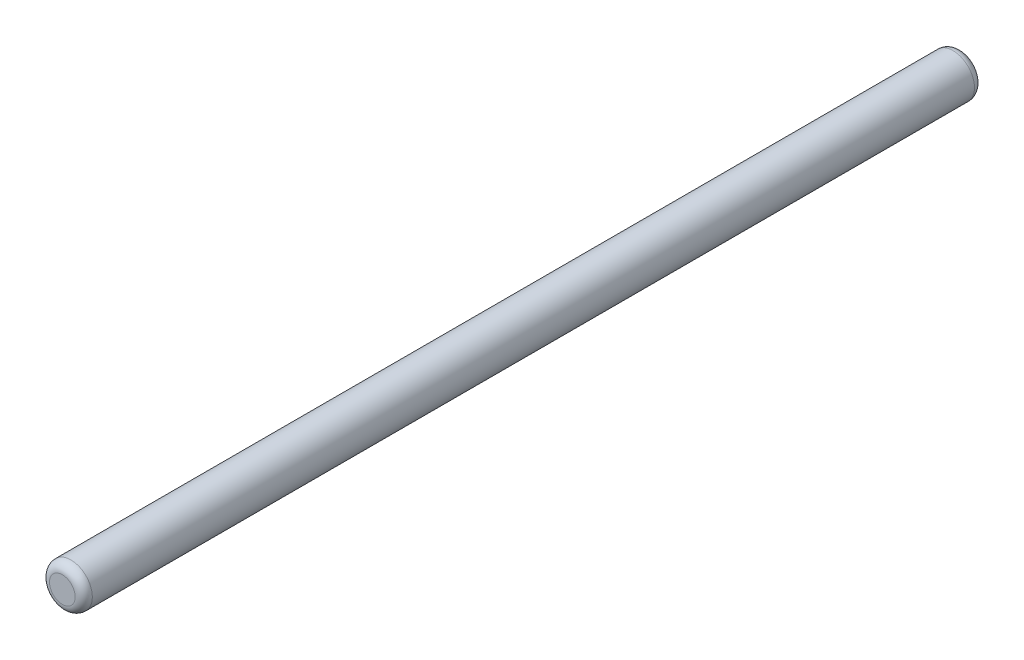
ISO-10303-21;
HEADER;
FILE_DESCRIPTION(('STEP AP214'),'2;1');
FILE_NAME('part.step','',(''),(''),'','','');
FILE_SCHEMA(('AUTOMOTIVE_DESIGN { 1 0 10303 214 1 1 1 1 }'));
ENDSEC;
DATA;
#1=APPLICATION_CONTEXT('core data for automotive mechanical design processes');
#2=APPLICATION_PROTOCOL_DEFINITION('international standard','automotive_design',2000,#1);
#3=PRODUCT_CONTEXT('',#1,'mechanical');
#4=PRODUCT('Part','Part','',(#3));
#5=PRODUCT_RELATED_PRODUCT_CATEGORY('part','',(#4));
#6=PRODUCT_DEFINITION_FORMATION('','',#4);
#7=PRODUCT_DEFINITION_CONTEXT('part definition',#1,'design');
#8=PRODUCT_DEFINITION('design','',#6,#7);
#9=PRODUCT_DEFINITION_SHAPE('','',#8);
#10=(LENGTH_UNIT() NAMED_UNIT(*) SI_UNIT(.MILLI.,.METRE.));
#11=(NAMED_UNIT(*) PLANE_ANGLE_UNIT() SI_UNIT($,.RADIAN.));
#12=(NAMED_UNIT(*) SI_UNIT($,.STERADIAN.) SOLID_ANGLE_UNIT());
#13=UNCERTAINTY_MEASURE_WITH_UNIT(LENGTH_MEASURE(1.E-05),#10,'distance_accuracy_value','');
#14=(GEOMETRIC_REPRESENTATION_CONTEXT(3) GLOBAL_UNCERTAINTY_ASSIGNED_CONTEXT((#13)) GLOBAL_UNIT_ASSIGNED_CONTEXT((#10,
#11,#12)) REPRESENTATION_CONTEXT('',''));
#15=CARTESIAN_POINT('',(0.,0.,0.));
#16=DIRECTION('',(0.,0.,1.));
#17=DIRECTION('',(1.,0.,0.));
#18=AXIS2_PLACEMENT_3D('',#15,#16,#17);
#19=CARTESIAN_POINT('',(0.,0.,105.));
#20=DIRECTION('',(0.,0.,-1.));
#21=DIRECTION('',(-1.,0.,0.));
#22=AXIS2_PLACEMENT_3D('',#19,#20,#21);
#23=CYLINDRICAL_SURFACE('',#22,2.5);
#24=CARTESIAN_POINT('',(0.,0.,1.));
#25=DIRECTION('',(0.,0.,1.));
#26=DIRECTION('',(1.,0.,0.));
#27=AXIS2_PLACEMENT_3D('',#24,#25,#26);
#28=CIRCLE('',#27,2.5);
#29=CARTESIAN_POINT('',(2.5,0.,1.));
#30=VERTEX_POINT('',#29);
#31=EDGE_CURVE('E44',#30,#30,#28,.T.);
#32=ORIENTED_EDGE('',*,*,#31,.T.);
#33=EDGE_LOOP('',(#32));
#34=FACE_BOUND('',#33,.T.);
#35=CARTESIAN_POINT('',(0.,0.,104.));
#36=DIRECTION('',(0.,0.,1.));
#37=DIRECTION('',(1.,0.,0.));
#38=AXIS2_PLACEMENT_3D('',#35,#36,#37);
#39=CIRCLE('',#38,2.5);
#40=CARTESIAN_POINT('',(2.5,0.,104.));
#41=VERTEX_POINT('',#40);
#42=EDGE_CURVE('E48',#41,#41,#39,.F.);
#43=ORIENTED_EDGE('',*,*,#42,.T.);
#44=EDGE_LOOP('',(#43));
#45=FACE_BOUND('',#44,.T.);
#46=ADVANCED_FACE('F33',(#34,#45),#23,.T.);
#47=CARTESIAN_POINT('',(0.,0.,105.));
#48=DIRECTION('',(0.,0.,1.));
#49=DIRECTION('',(1.,0.,0.));
#50=AXIS2_PLACEMENT_3D('',#47,#48,#49);
#51=PLANE('',#50);
#52=CARTESIAN_POINT('',(0.,0.,105.));
#53=DIRECTION('',(0.,0.,1.));
#54=DIRECTION('',(1.,0.,0.));
#55=AXIS2_PLACEMENT_3D('',#52,#53,#54);
#56=CIRCLE('',#55,1.5);
#57=CARTESIAN_POINT('',(1.5,0.,105.));
#58=VERTEX_POINT('',#57);
#59=EDGE_CURVE('E10',#58,#58,#56,.T.);
#60=ORIENTED_EDGE('',*,*,#59,.T.);
#61=EDGE_LOOP('',(#60));
#62=FACE_BOUND('',#61,.T.);
#63=ADVANCED_FACE('F64',(#62),#51,.T.);
#64=CARTESIAN_POINT('',(0.,0.,0.));
#65=DIRECTION('',(0.,0.,1.));
#66=DIRECTION('',(1.,0.,0.));
#67=AXIS2_PLACEMENT_3D('',#64,#65,#66);
#68=PLANE('',#67);
#69=CARTESIAN_POINT('',(0.,0.,0.));
#70=DIRECTION('',(0.,0.,1.));
#71=DIRECTION('',(1.,0.,0.));
#72=AXIS2_PLACEMENT_3D('',#69,#70,#71);
#73=CIRCLE('',#72,1.5);
#74=CARTESIAN_POINT('',(1.5,0.,0.));
#75=VERTEX_POINT('',#74);
#76=EDGE_CURVE('E40',#75,#75,#73,.F.);
#77=ORIENTED_EDGE('',*,*,#76,.T.);
#78=EDGE_LOOP('',(#77));
#79=FACE_BOUND('',#78,.T.);
#80=ADVANCED_FACE('F61',(#79),#68,.F.);
#81=CARTESIAN_POINT('',(0.,0.,1.));
#82=DIRECTION('',(0.,0.,1.));
#83=DIRECTION('',(1.,0.,0.));
#84=AXIS2_PLACEMENT_3D('',#81,#82,#83);
#85=TOROIDAL_SURFACE('',#84,1.5,1.);
#86=ORIENTED_EDGE('',*,*,#76,.F.);
#87=EDGE_LOOP('',(#86));
#88=FACE_BOUND('',#87,.T.);
#89=ORIENTED_EDGE('',*,*,#31,.F.);
#90=EDGE_LOOP('',(#89));
#91=FACE_BOUND('',#90,.T.);
#92=ADVANCED_FACE('F57',(#88,#91),#85,.T.);
#93=CARTESIAN_POINT('',(0.,0.,104.));
#94=DIRECTION('',(0.,0.,1.));
#95=DIRECTION('',(1.,0.,0.));
#96=AXIS2_PLACEMENT_3D('',#93,#94,#95);
#97=TOROIDAL_SURFACE('',#96,1.5,1.);
#98=ORIENTED_EDGE('',*,*,#42,.F.);
#99=EDGE_LOOP('',(#98));
#100=FACE_BOUND('',#99,.T.);
#101=ORIENTED_EDGE('',*,*,#59,.F.);
#102=EDGE_LOOP('',(#101));
#103=FACE_BOUND('',#102,.T.);
#104=ADVANCED_FACE('F35',(#100,#103),#97,.T.);
#105=CLOSED_SHELL('',(#46,#63,#80,#92,#104));
#106=MANIFOLD_SOLID_BREP('B2',#105);
#107=ADVANCED_BREP_SHAPE_REPRESENTATION('',(#18,#106),#14);
#108=SHAPE_DEFINITION_REPRESENTATION(#9,#107);
ENDSEC;
END-ISO-10303-21;
